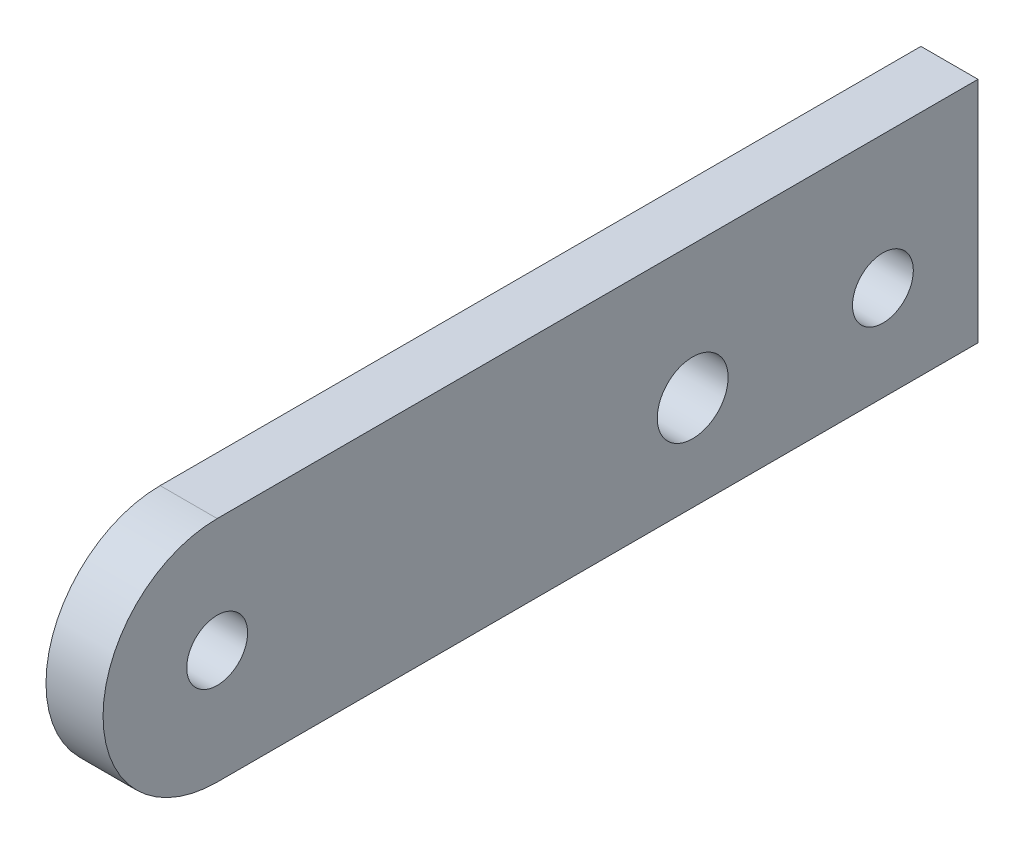
ISO-10303-21;
HEADER;
FILE_DESCRIPTION(('STEP AP214'),'2;1');
FILE_NAME('part.step','',(''),(''),'','','');
FILE_SCHEMA(('AUTOMOTIVE_DESIGN { 1 0 10303 214 1 1 1 1 }'));
ENDSEC;
DATA;
#1=APPLICATION_CONTEXT('core data for automotive mechanical design processes');
#2=APPLICATION_PROTOCOL_DEFINITION('international standard','automotive_design',2000,#1);
#3=PRODUCT_CONTEXT('',#1,'mechanical');
#4=PRODUCT('Part','Part','',(#3));
#5=PRODUCT_RELATED_PRODUCT_CATEGORY('part','',(#4));
#6=PRODUCT_DEFINITION_FORMATION('','',#4);
#7=PRODUCT_DEFINITION_CONTEXT('part definition',#1,'design');
#8=PRODUCT_DEFINITION('design','',#6,#7);
#9=PRODUCT_DEFINITION_SHAPE('','',#8);
#10=(LENGTH_UNIT() NAMED_UNIT(*) SI_UNIT(.MILLI.,.METRE.));
#11=(NAMED_UNIT(*) PLANE_ANGLE_UNIT() SI_UNIT($,.RADIAN.));
#12=(NAMED_UNIT(*) SI_UNIT($,.STERADIAN.) SOLID_ANGLE_UNIT());
#13=UNCERTAINTY_MEASURE_WITH_UNIT(LENGTH_MEASURE(1.E-05),#10,'distance_accuracy_value','');
#14=(GEOMETRIC_REPRESENTATION_CONTEXT(3) GLOBAL_UNCERTAINTY_ASSIGNED_CONTEXT((#13)) GLOBAL_UNIT_ASSIGNED_CONTEXT((#10,
#11,#12)) REPRESENTATION_CONTEXT('',''));
#15=CARTESIAN_POINT('',(0.,0.,0.));
#16=DIRECTION('',(0.,0.,1.));
#17=DIRECTION('',(1.,0.,0.));
#18=AXIS2_PLACEMENT_3D('',#15,#16,#17);
#19=CARTESIAN_POINT('',(3.,6.,0.));
#20=DIRECTION('',(0.,1.,0.));
#21=DIRECTION('',(0.,0.,1.));
#22=AXIS2_PLACEMENT_3D('',#19,#20,#21);
#23=PLANE('',#22);
#24=DIRECTION('',(0.,0.,-1.));
#25=VECTOR('',#24,1.);
#26=CARTESIAN_POINT('',(0.,6.,0.));
#27=LINE('',#26,#25);
#28=CARTESIAN_POINT('',(0.,6.,0.));
#29=VERTEX_POINT('',#28);
#30=CARTESIAN_POINT('',(0.,5.99999999999999,-40.));
#31=VERTEX_POINT('',#30);
#32=EDGE_CURVE('E109',#29,#31,#27,.T.);
#33=ORIENTED_EDGE('',*,*,#32,.F.);
#34=DIRECTION('',(-1.,0.,0.));
#35=VECTOR('',#34,1.);
#36=CARTESIAN_POINT('',(3.,6.,0.));
#37=LINE('',#36,#35);
#38=CARTESIAN_POINT('',(3.,6.,0.));
#39=VERTEX_POINT('',#38);
#40=EDGE_CURVE('E11',#39,#29,#37,.T.);
#41=ORIENTED_EDGE('',*,*,#40,.F.);
#42=DIRECTION('',(0.,0.,-1.));
#43=VECTOR('',#42,1.);
#44=CARTESIAN_POINT('',(3.,6.,0.));
#45=LINE('',#44,#43);
#46=CARTESIAN_POINT('',(3.,5.99999999999999,-40.));
#47=VERTEX_POINT('',#46);
#48=EDGE_CURVE('E85',#39,#47,#45,.T.);
#49=ORIENTED_EDGE('',*,*,#48,.T.);
#50=DIRECTION('',(-1.,0.,0.));
#51=VECTOR('',#50,1.);
#52=CARTESIAN_POINT('',(3.,5.99999999999999,-40.));
#53=LINE('',#52,#51);
#54=EDGE_CURVE('E52',#47,#31,#53,.T.);
#55=ORIENTED_EDGE('',*,*,#54,.T.);
#56=EDGE_LOOP('',(#33,#41,#49,#55));
#57=FACE_BOUND('',#56,.T.);
#58=ADVANCED_FACE('F35',(#57),#23,.T.);
#59=CARTESIAN_POINT('',(3.,0.,0.));
#60=DIRECTION('',(-1.,0.,0.));
#61=DIRECTION('',(0.,0.,1.));
#62=AXIS2_PLACEMENT_3D('',#59,#60,#61);
#63=CYLINDRICAL_SURFACE('',#62,6.);
#64=CARTESIAN_POINT('',(0.,0.,0.));
#65=DIRECTION('',(1.,0.,0.));
#66=DIRECTION('',(0.,0.,-1.));
#67=AXIS2_PLACEMENT_3D('',#64,#65,#66);
#68=CIRCLE('',#67,6.);
#69=CARTESIAN_POINT('',(0.,-6.,0.));
#70=VERTEX_POINT('',#69);
#71=EDGE_CURVE('E91',#29,#70,#68,.T.);
#72=ORIENTED_EDGE('',*,*,#71,.T.);
#73=DIRECTION('',(-1.,0.,0.));
#74=VECTOR('',#73,1.);
#75=CARTESIAN_POINT('',(3.,-6.,0.));
#76=LINE('',#75,#74);
#77=CARTESIAN_POINT('',(3.,-6.,0.));
#78=VERTEX_POINT('',#77);
#79=EDGE_CURVE('E44',#78,#70,#76,.T.);
#80=ORIENTED_EDGE('',*,*,#79,.F.);
#81=CARTESIAN_POINT('',(3.,0.,0.));
#82=DIRECTION('',(1.,0.,0.));
#83=DIRECTION('',(0.,0.,-1.));
#84=AXIS2_PLACEMENT_3D('',#81,#82,#83);
#85=CIRCLE('',#84,6.);
#86=EDGE_CURVE('E78',#39,#78,#85,.T.);
#87=ORIENTED_EDGE('',*,*,#86,.F.);
#88=ORIENTED_EDGE('',*,*,#40,.T.);
#89=EDGE_LOOP('',(#72,#80,#87,#88));
#90=FACE_BOUND('',#89,.T.);
#91=ADVANCED_FACE('F89',(#90),#63,.T.);
#92=CARTESIAN_POINT('',(3.,-6.,0.));
#93=DIRECTION('',(0.,-1.,0.));
#94=DIRECTION('',(0.,0.,-1.));
#95=AXIS2_PLACEMENT_3D('',#92,#93,#94);
#96=PLANE('',#95);
#97=DIRECTION('',(0.,0.,1.));
#98=VECTOR('',#97,1.);
#99=CARTESIAN_POINT('',(0.,-6.,0.));
#100=LINE('',#99,#98);
#101=CARTESIAN_POINT('',(0.,-5.99999999999999,-40.));
#102=VERTEX_POINT('',#101);
#103=EDGE_CURVE('E112',#102,#70,#100,.T.);
#104=ORIENTED_EDGE('',*,*,#103,.F.);
#105=DIRECTION('',(-1.,0.,0.));
#106=VECTOR('',#105,1.);
#107=CARTESIAN_POINT('',(3.,-5.99999999999999,-40.));
#108=LINE('',#107,#106);
#109=CARTESIAN_POINT('',(3.,-5.99999999999999,-40.));
#110=VERTEX_POINT('',#109);
#111=EDGE_CURVE('E65',#110,#102,#108,.T.);
#112=ORIENTED_EDGE('',*,*,#111,.F.);
#113=DIRECTION('',(0.,0.,1.));
#114=VECTOR('',#113,1.);
#115=CARTESIAN_POINT('',(3.,-6.,0.));
#116=LINE('',#115,#114);
#117=EDGE_CURVE('E84',#110,#78,#116,.T.);
#118=ORIENTED_EDGE('',*,*,#117,.T.);
#119=ORIENTED_EDGE('',*,*,#79,.T.);
#120=EDGE_LOOP('',(#104,#112,#118,#119));
#121=FACE_BOUND('',#120,.T.);
#122=ADVANCED_FACE('F94',(#121),#96,.T.);
#123=CARTESIAN_POINT('',(3.,0.,-40.));
#124=DIRECTION('',(0.,0.,-1.));
#125=DIRECTION('',(-1.,0.,0.));
#126=AXIS2_PLACEMENT_3D('',#123,#124,#125);
#127=PLANE('',#126);
#128=DIRECTION('',(0.,-1.,0.));
#129=VECTOR('',#128,1.);
#130=CARTESIAN_POINT('',(0.,0.,-40.));
#131=LINE('',#130,#129);
#132=EDGE_CURVE('E114',#31,#102,#131,.T.);
#133=ORIENTED_EDGE('',*,*,#132,.F.);
#134=ORIENTED_EDGE('',*,*,#54,.F.);
#135=DIRECTION('',(0.,-1.,0.));
#136=VECTOR('',#135,1.);
#137=CARTESIAN_POINT('',(3.,0.,-40.));
#138=LINE('',#137,#136);
#139=EDGE_CURVE('E95',#47,#110,#138,.T.);
#140=ORIENTED_EDGE('',*,*,#139,.T.);
#141=ORIENTED_EDGE('',*,*,#111,.T.);
#142=EDGE_LOOP('',(#133,#134,#140,#141));
#143=FACE_BOUND('',#142,.T.);
#144=ADVANCED_FACE('F131',(#143),#127,.T.);
#145=CARTESIAN_POINT('',(3.,-1.,-25.));
#146=DIRECTION('',(-1.,0.,0.));
#147=DIRECTION('',(0.,0.,1.));
#148=AXIS2_PLACEMENT_3D('',#145,#146,#147);
#149=CYLINDRICAL_SURFACE('',#148,1.86281595800535);
#150=CARTESIAN_POINT('',(3.,-1.,-25.));
#151=DIRECTION('',(1.,0.,0.));
#152=DIRECTION('',(0.,0.,-1.));
#153=AXIS2_PLACEMENT_3D('',#150,#151,#152);
#154=CIRCLE('',#153,1.86281595800535);
#155=CARTESIAN_POINT('',(3.,-1.,-26.8628159580054));
#156=VERTEX_POINT('',#155);
#157=EDGE_CURVE('E125',#156,#156,#154,.T.);
#158=ORIENTED_EDGE('',*,*,#157,.T.);
#159=EDGE_LOOP('',(#158));
#160=FACE_BOUND('',#159,.T.);
#161=CARTESIAN_POINT('',(0.,-1.,-25.));
#162=DIRECTION('',(1.,0.,0.));
#163=DIRECTION('',(0.,0.,-1.));
#164=AXIS2_PLACEMENT_3D('',#161,#162,#163);
#165=CIRCLE('',#164,1.86281595800535);
#166=CARTESIAN_POINT('',(0.,-1.,-26.8628159580054));
#167=VERTEX_POINT('',#166);
#168=EDGE_CURVE('E106',#167,#167,#165,.T.);
#169=ORIENTED_EDGE('',*,*,#168,.F.);
#170=EDGE_LOOP('',(#169));
#171=FACE_BOUND('',#170,.T.);
#172=ADVANCED_FACE('F133',(#160,#171),#149,.F.);
#173=CARTESIAN_POINT('',(3.,-1.,-35.));
#174=DIRECTION('',(-1.,0.,0.));
#175=DIRECTION('',(0.,0.,1.));
#176=AXIS2_PLACEMENT_3D('',#173,#174,#175);
#177=CYLINDRICAL_SURFACE('',#176,1.6);
#178=CARTESIAN_POINT('',(3.,-1.,-35.));
#179=DIRECTION('',(1.,0.,0.));
#180=DIRECTION('',(0.,0.,-1.));
#181=AXIS2_PLACEMENT_3D('',#178,#179,#180);
#182=CIRCLE('',#181,1.6);
#183=CARTESIAN_POINT('',(3.,-1.,-36.6));
#184=VERTEX_POINT('',#183);
#185=EDGE_CURVE('E120',#184,#184,#182,.T.);
#186=ORIENTED_EDGE('',*,*,#185,.T.);
#187=EDGE_LOOP('',(#186));
#188=FACE_BOUND('',#187,.T.);
#189=CARTESIAN_POINT('',(0.,-1.,-35.));
#190=DIRECTION('',(1.,0.,0.));
#191=DIRECTION('',(0.,0.,-1.));
#192=AXIS2_PLACEMENT_3D('',#189,#190,#191);
#193=CIRCLE('',#192,1.6);
#194=CARTESIAN_POINT('',(0.,-1.,-36.6));
#195=VERTEX_POINT('',#194);
#196=EDGE_CURVE('E103',#195,#195,#193,.T.);
#197=ORIENTED_EDGE('',*,*,#196,.F.);
#198=EDGE_LOOP('',(#197));
#199=FACE_BOUND('',#198,.T.);
#200=ADVANCED_FACE('F37',(#188,#199),#177,.F.);
#201=CARTESIAN_POINT('',(3.,0.,0.));
#202=DIRECTION('',(-1.,0.,0.));
#203=DIRECTION('',(0.,0.,1.));
#204=AXIS2_PLACEMENT_3D('',#201,#202,#203);
#205=CYLINDRICAL_SURFACE('',#204,1.6);
#206=CARTESIAN_POINT('',(3.,0.,0.));
#207=DIRECTION('',(1.,0.,0.));
#208=DIRECTION('',(0.,0.,-1.));
#209=AXIS2_PLACEMENT_3D('',#206,#207,#208);
#210=CIRCLE('',#209,1.6);
#211=CARTESIAN_POINT('',(3.,0.,-1.6));
#212=VERTEX_POINT('',#211);
#213=EDGE_CURVE('E97',#212,#212,#210,.T.);
#214=ORIENTED_EDGE('',*,*,#213,.T.);
#215=EDGE_LOOP('',(#214));
#216=FACE_BOUND('',#215,.T.);
#217=CARTESIAN_POINT('',(0.,0.,0.));
#218=DIRECTION('',(1.,0.,0.));
#219=DIRECTION('',(0.,0.,-1.));
#220=AXIS2_PLACEMENT_3D('',#217,#218,#219);
#221=CIRCLE('',#220,1.6);
#222=CARTESIAN_POINT('',(0.,0.,-1.6));
#223=VERTEX_POINT('',#222);
#224=EDGE_CURVE('E117',#223,#223,#221,.T.);
#225=ORIENTED_EDGE('',*,*,#224,.F.);
#226=EDGE_LOOP('',(#225));
#227=FACE_BOUND('',#226,.T.);
#228=ADVANCED_FACE('F173',(#216,#227),#205,.F.);
#229=CARTESIAN_POINT('',(3.,0.,0.));
#230=DIRECTION('',(1.,0.,0.));
#231=DIRECTION('',(0.,0.,-1.));
#232=AXIS2_PLACEMENT_3D('',#229,#230,#231);
#233=PLANE('',#232);
#234=ORIENTED_EDGE('',*,*,#185,.F.);
#235=EDGE_LOOP('',(#234));
#236=FACE_BOUND('',#235,.T.);
#237=ORIENTED_EDGE('',*,*,#157,.F.);
#238=EDGE_LOOP('',(#237));
#239=FACE_BOUND('',#238,.T.);
#240=ORIENTED_EDGE('',*,*,#48,.F.);
#241=ORIENTED_EDGE('',*,*,#86,.T.);
#242=ORIENTED_EDGE('',*,*,#117,.F.);
#243=ORIENTED_EDGE('',*,*,#139,.F.);
#244=EDGE_LOOP('',(#240,#241,#242,#243));
#245=FACE_BOUND('',#244,.T.);
#246=ORIENTED_EDGE('',*,*,#213,.F.);
#247=EDGE_LOOP('',(#246));
#248=FACE_BOUND('',#247,.T.);
#249=ADVANCED_FACE('F80',(#236,#239,#245,#248),#233,.T.);
#250=CARTESIAN_POINT('',(0.,0.,0.));
#251=DIRECTION('',(1.,0.,0.));
#252=DIRECTION('',(0.,0.,-1.));
#253=AXIS2_PLACEMENT_3D('',#250,#251,#252);
#254=PLANE('',#253);
#255=ORIENTED_EDGE('',*,*,#196,.T.);
#256=EDGE_LOOP('',(#255));
#257=FACE_BOUND('',#256,.T.);
#258=ORIENTED_EDGE('',*,*,#168,.T.);
#259=EDGE_LOOP('',(#258));
#260=FACE_BOUND('',#259,.T.);
#261=ORIENTED_EDGE('',*,*,#32,.T.);
#262=ORIENTED_EDGE('',*,*,#132,.T.);
#263=ORIENTED_EDGE('',*,*,#103,.T.);
#264=ORIENTED_EDGE('',*,*,#71,.F.);
#265=EDGE_LOOP('',(#261,#262,#263,#264));
#266=FACE_BOUND('',#265,.T.);
#267=ORIENTED_EDGE('',*,*,#224,.T.);
#268=EDGE_LOOP('',(#267));
#269=FACE_BOUND('',#268,.T.);
#270=ADVANCED_FACE('F190',(#257,#260,#266,#269),#254,.F.);
#271=CLOSED_SHELL('',(#58,#91,#122,#144,#172,#200,#228,#249,#270));
#272=MANIFOLD_SOLID_BREP('B2',#271);
#273=ADVANCED_BREP_SHAPE_REPRESENTATION('',(#18,#272),#14);
#274=SHAPE_DEFINITION_REPRESENTATION(#9,#273);
ENDSEC;
END-ISO-10303-21;
